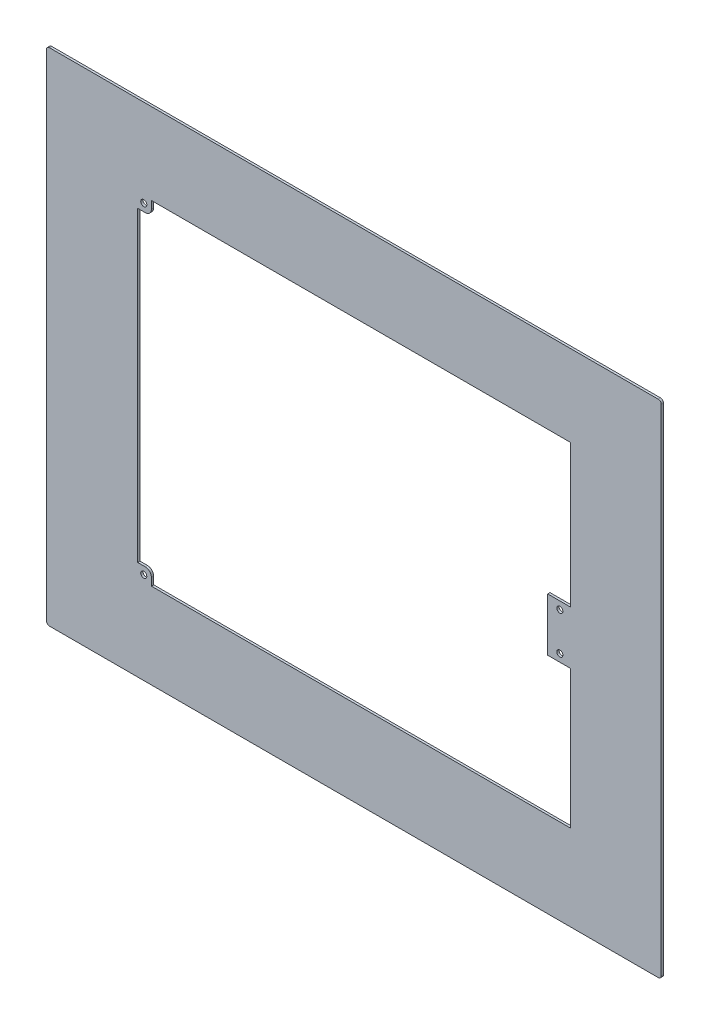
ISO-10303-21;
HEADER;
FILE_DESCRIPTION(('STEP AP214'),'2;1');
FILE_NAME('part.step','',(''),(''),'','','');
FILE_SCHEMA(('AUTOMOTIVE_DESIGN { 1 0 10303 214 1 1 1 1 }'));
ENDSEC;
DATA;
#1=APPLICATION_CONTEXT('core data for automotive mechanical design processes');
#2=APPLICATION_PROTOCOL_DEFINITION('international standard','automotive_design',2000,#1);
#3=PRODUCT_CONTEXT('',#1,'mechanical');
#4=PRODUCT('Part','Part','',(#3));
#5=PRODUCT_RELATED_PRODUCT_CATEGORY('part','',(#4));
#6=PRODUCT_DEFINITION_FORMATION('','',#4);
#7=PRODUCT_DEFINITION_CONTEXT('part definition',#1,'design');
#8=PRODUCT_DEFINITION('design','',#6,#7);
#9=PRODUCT_DEFINITION_SHAPE('','',#8);
#10=(LENGTH_UNIT() NAMED_UNIT(*) SI_UNIT(.MILLI.,.METRE.));
#11=(NAMED_UNIT(*) PLANE_ANGLE_UNIT() SI_UNIT($,.RADIAN.));
#12=(NAMED_UNIT(*) SI_UNIT($,.STERADIAN.) SOLID_ANGLE_UNIT());
#13=UNCERTAINTY_MEASURE_WITH_UNIT(LENGTH_MEASURE(1.E-05),#10,'distance_accuracy_value','');
#14=(GEOMETRIC_REPRESENTATION_CONTEXT(3) GLOBAL_UNCERTAINTY_ASSIGNED_CONTEXT((#13)) GLOBAL_UNIT_ASSIGNED_CONTEXT((#10,
#11,#12)) REPRESENTATION_CONTEXT('',''));
#15=CARTESIAN_POINT('',(0.,0.,0.));
#16=DIRECTION('',(0.,0.,1.));
#17=DIRECTION('',(1.,0.,0.));
#18=AXIS2_PLACEMENT_3D('',#15,#16,#17);
#19=CARTESIAN_POINT('',(142.71,111.43,0.));
#20=DIRECTION('',(1.,0.,0.));
#21=DIRECTION('',(0.,1.,0.));
#22=AXIS2_PLACEMENT_3D('',#19,#20,#21);
#23=PLANE('',#22);
#24=DIRECTION('',(0.,1.,0.));
#25=VECTOR('',#24,1.);
#26=CARTESIAN_POINT('',(142.71,111.43,0.));
#27=LINE('',#26,#25);
#28=CARTESIAN_POINT('',(142.71,17.5,0.));
#29=VERTEX_POINT('',#28);
#30=CARTESIAN_POINT('',(142.71,111.43,0.));
#31=VERTEX_POINT('',#30);
#32=EDGE_CURVE('E259',#29,#31,#27,.T.);
#33=ORIENTED_EDGE('',*,*,#32,.F.);
#34=DIRECTION('',(0.,0.,1.));
#35=VECTOR('',#34,1.);
#36=CARTESIAN_POINT('',(142.71,17.5,-38.0788655293196));
#37=LINE('',#36,#35);
#38=CARTESIAN_POINT('',(142.71,17.5,1.5));
#39=VERTEX_POINT('',#38);
#40=EDGE_CURVE('E205',#29,#39,#37,.T.);
#41=ORIENTED_EDGE('',*,*,#40,.T.);
#42=DIRECTION('',(0.,1.,0.));
#43=VECTOR('',#42,1.);
#44=CARTESIAN_POINT('',(142.71,111.43,1.5));
#45=LINE('',#44,#43);
#46=CARTESIAN_POINT('',(142.71,111.43,1.5));
#47=VERTEX_POINT('',#46);
#48=EDGE_CURVE('E270',#39,#47,#45,.T.);
#49=ORIENTED_EDGE('',*,*,#48,.T.);
#50=DIRECTION('',(0.,0.,1.));
#51=VECTOR('',#50,1.);
#52=CARTESIAN_POINT('',(142.71,111.43,0.));
#53=LINE('',#52,#51);
#54=EDGE_CURVE('E276',#31,#47,#53,.T.);
#55=ORIENTED_EDGE('',*,*,#54,.F.);
#56=EDGE_LOOP('',(#33,#41,#49,#55));
#57=FACE_BOUND('',#56,.T.);
#58=ADVANCED_FACE('F33',(#57),#23,.F.);
#59=CARTESIAN_POINT('',(202.5,-165.,1.5));
#60=DIRECTION('',(-1.,0.,0.));
#61=DIRECTION('',(0.,0.,1.));
#62=AXIS2_PLACEMENT_3D('',#59,#60,#61);
#63=PLANE('',#62);
#64=DIRECTION('',(0.,1.,0.));
#65=VECTOR('',#64,1.);
#66=CARTESIAN_POINT('',(202.5,-165.,0.));
#67=LINE('',#66,#65);
#68=CARTESIAN_POINT('',(202.5,-163.,0.));
#69=VERTEX_POINT('',#68);
#70=CARTESIAN_POINT('',(202.5,163.,0.));
#71=VERTEX_POINT('',#70);
#72=EDGE_CURVE('E279',#69,#71,#67,.T.);
#73=ORIENTED_EDGE('',*,*,#72,.T.);
#74=DIRECTION('',(0.,0.,-1.));
#75=VECTOR('',#74,1.);
#76=CARTESIAN_POINT('',(202.5,163.,1.5));
#77=LINE('',#76,#75);
#78=CARTESIAN_POINT('',(202.5,163.,1.5));
#79=VERTEX_POINT('',#78);
#80=EDGE_CURVE('E348',#71,#79,#77,.F.);
#81=ORIENTED_EDGE('',*,*,#80,.T.);
#82=DIRECTION('',(0.,1.,0.));
#83=VECTOR('',#82,1.);
#84=CARTESIAN_POINT('',(202.5,-165.,1.5));
#85=LINE('',#84,#83);
#86=CARTESIAN_POINT('',(202.5,-163.,1.5));
#87=VERTEX_POINT('',#86);
#88=EDGE_CURVE('E282',#87,#79,#85,.T.);
#89=ORIENTED_EDGE('',*,*,#88,.F.);
#90=DIRECTION('',(0.,0.,-1.));
#91=VECTOR('',#90,1.);
#92=CARTESIAN_POINT('',(202.5,-163.,1.5));
#93=LINE('',#92,#91);
#94=EDGE_CURVE('E345',#87,#69,#93,.T.);
#95=ORIENTED_EDGE('',*,*,#94,.T.);
#96=EDGE_LOOP('',(#73,#81,#89,#95));
#97=FACE_BOUND('',#96,.T.);
#98=ADVANCED_FACE('F362',(#97),#63,.F.);
#99=CARTESIAN_POINT('',(-202.5,165.,1.5));
#100=DIRECTION('',(0.,-1.,0.));
#101=DIRECTION('',(0.,0.,-1.));
#102=AXIS2_PLACEMENT_3D('',#99,#100,#101);
#103=PLANE('',#102);
#104=DIRECTION('',(-1.,0.,0.));
#105=VECTOR('',#104,1.);
#106=CARTESIAN_POINT('',(-202.5,165.,0.));
#107=LINE('',#106,#105);
#108=CARTESIAN_POINT('',(200.5,165.,0.));
#109=VERTEX_POINT('',#108);
#110=CARTESIAN_POINT('',(-200.5,165.,0.));
#111=VERTEX_POINT('',#110);
#112=EDGE_CURVE('E296',#109,#111,#107,.T.);
#113=ORIENTED_EDGE('',*,*,#112,.T.);
#114=DIRECTION('',(0.,0.,-1.));
#115=VECTOR('',#114,1.);
#116=CARTESIAN_POINT('',(-200.5,165.,1.5));
#117=LINE('',#116,#115);
#118=CARTESIAN_POINT('',(-200.5,165.,1.5));
#119=VERTEX_POINT('',#118);
#120=EDGE_CURVE('E336',#111,#119,#117,.F.);
#121=ORIENTED_EDGE('',*,*,#120,.T.);
#122=DIRECTION('',(-1.,0.,0.));
#123=VECTOR('',#122,1.);
#124=CARTESIAN_POINT('',(-202.5,165.,1.5));
#125=LINE('',#124,#123);
#126=CARTESIAN_POINT('',(200.5,165.,1.5));
#127=VERTEX_POINT('',#126);
#128=EDGE_CURVE('E285',#127,#119,#125,.T.);
#129=ORIENTED_EDGE('',*,*,#128,.F.);
#130=DIRECTION('',(0.,0.,-1.));
#131=VECTOR('',#130,1.);
#132=CARTESIAN_POINT('',(200.5,165.,1.5));
#133=LINE('',#132,#131);
#134=EDGE_CURVE('E333',#127,#109,#133,.T.);
#135=ORIENTED_EDGE('',*,*,#134,.T.);
#136=EDGE_LOOP('',(#113,#121,#129,#135));
#137=FACE_BOUND('',#136,.T.);
#138=ADVANCED_FACE('F372',(#137),#103,.F.);
#139=CARTESIAN_POINT('',(-202.5,-165.,1.5));
#140=DIRECTION('',(1.,0.,0.));
#141=DIRECTION('',(0.,0.,-1.));
#142=AXIS2_PLACEMENT_3D('',#139,#140,#141);
#143=PLANE('',#142);
#144=DIRECTION('',(0.,-1.,0.));
#145=VECTOR('',#144,1.);
#146=CARTESIAN_POINT('',(-202.5,-165.,1.5));
#147=LINE('',#146,#145);
#148=CARTESIAN_POINT('',(-202.5,163.,1.5));
#149=VERTEX_POINT('',#148);
#150=CARTESIAN_POINT('',(-202.5,-163.,1.5));
#151=VERTEX_POINT('',#150);
#152=EDGE_CURVE('E289',#149,#151,#147,.T.);
#153=ORIENTED_EDGE('',*,*,#152,.F.);
#154=DIRECTION('',(0.,0.,-1.));
#155=VECTOR('',#154,1.);
#156=CARTESIAN_POINT('',(-202.5,163.,1.5));
#157=LINE('',#156,#155);
#158=CARTESIAN_POINT('',(-202.5,163.,0.));
#159=VERTEX_POINT('',#158);
#160=EDGE_CURVE('E322',#149,#159,#157,.T.);
#161=ORIENTED_EDGE('',*,*,#160,.T.);
#162=DIRECTION('',(0.,-1.,0.));
#163=VECTOR('',#162,1.);
#164=CARTESIAN_POINT('',(-202.5,-165.,0.));
#165=LINE('',#164,#163);
#166=CARTESIAN_POINT('',(-202.5,-163.,0.));
#167=VERTEX_POINT('',#166);
#168=EDGE_CURVE('E299',#159,#167,#165,.T.);
#169=ORIENTED_EDGE('',*,*,#168,.T.);
#170=DIRECTION('',(0.,0.,-1.));
#171=VECTOR('',#170,1.);
#172=CARTESIAN_POINT('',(-202.5,-163.,1.5));
#173=LINE('',#172,#171);
#174=EDGE_CURVE('E320',#167,#151,#173,.F.);
#175=ORIENTED_EDGE('',*,*,#174,.T.);
#176=EDGE_LOOP('',(#153,#161,#169,#175));
#177=FACE_BOUND('',#176,.T.);
#178=ADVANCED_FACE('F380',(#177),#143,.F.);
#179=CARTESIAN_POINT('',(-202.5,-165.,1.5));
#180=DIRECTION('',(0.,1.,0.));
#181=DIRECTION('',(0.,0.,1.));
#182=AXIS2_PLACEMENT_3D('',#179,#180,#181);
#183=PLANE('',#182);
#184=DIRECTION('',(1.,0.,0.));
#185=VECTOR('',#184,1.);
#186=CARTESIAN_POINT('',(-202.5,-165.,0.));
#187=LINE('',#186,#185);
#188=CARTESIAN_POINT('',(-200.5,-165.,0.));
#189=VERTEX_POINT('',#188);
#190=CARTESIAN_POINT('',(200.5,-165.,0.));
#191=VERTEX_POINT('',#190);
#192=EDGE_CURVE('E286',#189,#191,#187,.T.);
#193=ORIENTED_EDGE('',*,*,#192,.T.);
#194=DIRECTION('',(0.,0.,-1.));
#195=VECTOR('',#194,1.);
#196=CARTESIAN_POINT('',(200.5,-165.,1.5));
#197=LINE('',#196,#195);
#198=CARTESIAN_POINT('',(200.5,-165.,1.5));
#199=VERTEX_POINT('',#198);
#200=EDGE_CURVE('E11',#191,#199,#197,.F.);
#201=ORIENTED_EDGE('',*,*,#200,.T.);
#202=DIRECTION('',(1.,0.,0.));
#203=VECTOR('',#202,1.);
#204=CARTESIAN_POINT('',(-202.5,-165.,1.5));
#205=LINE('',#204,#203);
#206=CARTESIAN_POINT('',(-200.5,-165.,1.5));
#207=VERTEX_POINT('',#206);
#208=EDGE_CURVE('E291',#207,#199,#205,.T.);
#209=ORIENTED_EDGE('',*,*,#208,.F.);
#210=DIRECTION('',(0.,0.,-1.));
#211=VECTOR('',#210,1.);
#212=CARTESIAN_POINT('',(-200.5,-165.,1.5));
#213=LINE('',#212,#211);
#214=EDGE_CURVE('E41',#207,#189,#213,.T.);
#215=ORIENTED_EDGE('',*,*,#214,.T.);
#216=EDGE_LOOP('',(#193,#201,#209,#215));
#217=FACE_BOUND('',#216,.T.);
#218=ADVANCED_FACE('F352',(#217),#183,.F.);
#219=CARTESIAN_POINT('',(0.,0.,1.5));
#220=DIRECTION('',(0.,0.,-1.));
#221=DIRECTION('',(-1.,0.,0.));
#222=AXIS2_PLACEMENT_3D('',#219,#220,#221);
#223=PLANE('',#222);
#224=CARTESIAN_POINT('',(-138.41,107.43,1.5));
#225=DIRECTION('',(0.,0.,1.));
#226=DIRECTION('',(1.,0.,0.));
#227=AXIS2_PLACEMENT_3D('',#224,#225,#226);
#228=CIRCLE('',#227,2.);
#229=CARTESIAN_POINT('',(-136.41,107.43,1.5));
#230=VERTEX_POINT('',#229);
#231=EDGE_CURVE('E465',#230,#230,#228,.T.);
#232=ORIENTED_EDGE('',*,*,#231,.F.);
#233=EDGE_LOOP('',(#232));
#234=FACE_BOUND('',#233,.T.);
#235=CARTESIAN_POINT('',(135.71,-12.5,1.5));
#236=DIRECTION('',(0.,0.,1.));
#237=DIRECTION('',(1.,0.,0.));
#238=AXIS2_PLACEMENT_3D('',#235,#236,#237);
#239=CIRCLE('',#238,2.);
#240=CARTESIAN_POINT('',(137.71,-12.5,1.5));
#241=VERTEX_POINT('',#240);
#242=EDGE_CURVE('E477',#241,#241,#239,.T.);
#243=ORIENTED_EDGE('',*,*,#242,.F.);
#244=EDGE_LOOP('',(#243));
#245=FACE_BOUND('',#244,.T.);
#246=CARTESIAN_POINT('',(135.71,12.5,1.5));
#247=DIRECTION('',(0.,0.,1.));
#248=DIRECTION('',(1.,0.,0.));
#249=AXIS2_PLACEMENT_3D('',#246,#247,#248);
#250=CIRCLE('',#249,2.);
#251=CARTESIAN_POINT('',(137.71,12.5,1.5));
#252=VERTEX_POINT('',#251);
#253=EDGE_CURVE('E476',#252,#252,#250,.T.);
#254=ORIENTED_EDGE('',*,*,#253,.F.);
#255=EDGE_LOOP('',(#254));
#256=FACE_BOUND('',#255,.T.);
#257=CARTESIAN_POINT('',(-138.41,-104.6,1.5));
#258=DIRECTION('',(0.,0.,1.));
#259=DIRECTION('',(1.,0.,0.));
#260=AXIS2_PLACEMENT_3D('',#257,#258,#259);
#261=CIRCLE('',#260,2.);
#262=CARTESIAN_POINT('',(-136.41,-104.6,1.5));
#263=VERTEX_POINT('',#262);
#264=EDGE_CURVE('E482',#263,#263,#261,.T.);
#265=ORIENTED_EDGE('',*,*,#264,.F.);
#266=EDGE_LOOP('',(#265));
#267=FACE_BOUND('',#266,.T.);
#268=DIRECTION('',(0.,1.,0.));
#269=VECTOR('',#268,1.);
#270=CARTESIAN_POINT('',(-133.41,-108.6,1.5));
#271=LINE('',#270,#269);
#272=CARTESIAN_POINT('',(-133.41,-108.6,1.5));
#273=VERTEX_POINT('',#272);
#274=CARTESIAN_POINT('',(-133.41,-103.6,1.5));
#275=VERTEX_POINT('',#274);
#276=EDGE_CURVE('E220',#273,#275,#271,.T.);
#277=ORIENTED_EDGE('',*,*,#276,.T.);
#278=CARTESIAN_POINT('',(-137.41,-103.6,1.5));
#279=DIRECTION('',(0.,0.,-1.));
#280=DIRECTION('',(-1.,0.,0.));
#281=AXIS2_PLACEMENT_3D('',#278,#279,#280);
#282=CIRCLE('',#281,4.);
#283=CARTESIAN_POINT('',(-137.41,-99.6,1.5));
#284=VERTEX_POINT('',#283);
#285=EDGE_CURVE('E307',#275,#284,#282,.F.);
#286=ORIENTED_EDGE('',*,*,#285,.T.);
#287=DIRECTION('',(-1.,0.,0.));
#288=VECTOR('',#287,1.);
#289=CARTESIAN_POINT('',(-142.41,-99.6,1.5));
#290=LINE('',#289,#288);
#291=CARTESIAN_POINT('',(-142.41,-99.6,1.5));
#292=VERTEX_POINT('',#291);
#293=EDGE_CURVE('E221',#284,#292,#290,.T.);
#294=ORIENTED_EDGE('',*,*,#293,.T.);
#295=DIRECTION('',(0.,-1.,0.));
#296=VECTOR('',#295,1.);
#297=CARTESIAN_POINT('',(-142.41,111.43,1.5));
#298=LINE('',#297,#296);
#299=CARTESIAN_POINT('',(-142.41,102.43,1.5));
#300=VERTEX_POINT('',#299);
#301=EDGE_CURVE('E252',#300,#292,#298,.T.);
#302=ORIENTED_EDGE('',*,*,#301,.F.);
#303=DIRECTION('',(1.,0.,0.));
#304=VECTOR('',#303,1.);
#305=CARTESIAN_POINT('',(-142.41,102.43,1.5));
#306=LINE('',#305,#304);
#307=CARTESIAN_POINT('',(-137.41,102.43,1.5));
#308=VERTEX_POINT('',#307);
#309=EDGE_CURVE('E234',#300,#308,#306,.T.);
#310=ORIENTED_EDGE('',*,*,#309,.T.);
#311=CARTESIAN_POINT('',(-137.41,106.43,1.5));
#312=DIRECTION('',(0.,0.,-1.));
#313=DIRECTION('',(-1.,0.,0.));
#314=AXIS2_PLACEMENT_3D('',#311,#312,#313);
#315=CIRCLE('',#314,4.);
#316=CARTESIAN_POINT('',(-133.41,106.43,1.5));
#317=VERTEX_POINT('',#316);
#318=EDGE_CURVE('E305',#308,#317,#315,.F.);
#319=ORIENTED_EDGE('',*,*,#318,.T.);
#320=DIRECTION('',(0.,1.,0.));
#321=VECTOR('',#320,1.);
#322=CARTESIAN_POINT('',(-133.41,111.43,1.5));
#323=LINE('',#322,#321);
#324=CARTESIAN_POINT('',(-133.41,111.43,1.5));
#325=VERTEX_POINT('',#324);
#326=EDGE_CURVE('E237',#317,#325,#323,.T.);
#327=ORIENTED_EDGE('',*,*,#326,.T.);
#328=DIRECTION('',(-1.,0.,0.));
#329=VECTOR('',#328,1.);
#330=CARTESIAN_POINT('',(-142.41,111.43,1.5));
#331=LINE('',#330,#329);
#332=EDGE_CURVE('E257',#47,#325,#331,.T.);
#333=ORIENTED_EDGE('',*,*,#332,.F.);
#334=ORIENTED_EDGE('',*,*,#48,.F.);
#335=DIRECTION('',(-1.,0.,0.));
#336=VECTOR('',#335,1.);
#337=CARTESIAN_POINT('',(142.71,17.5,1.5));
#338=LINE('',#337,#336);
#339=CARTESIAN_POINT('',(127.71,17.5,1.5));
#340=VERTEX_POINT('',#339);
#341=EDGE_CURVE('E213',#39,#340,#338,.T.);
#342=ORIENTED_EDGE('',*,*,#341,.T.);
#343=DIRECTION('',(0.,-1.,0.));
#344=VECTOR('',#343,1.);
#345=CARTESIAN_POINT('',(127.71,17.5,1.5));
#346=LINE('',#345,#344);
#347=CARTESIAN_POINT('',(127.71,-17.5,1.5));
#348=VERTEX_POINT('',#347);
#349=EDGE_CURVE('E199',#340,#348,#346,.T.);
#350=ORIENTED_EDGE('',*,*,#349,.T.);
#351=DIRECTION('',(1.,0.,0.));
#352=VECTOR('',#351,1.);
#353=CARTESIAN_POINT('',(142.71,-17.5,1.5));
#354=LINE('',#353,#352);
#355=CARTESIAN_POINT('',(142.71,-17.5,1.5));
#356=VERTEX_POINT('',#355);
#357=EDGE_CURVE('E207',#348,#356,#354,.T.);
#358=ORIENTED_EDGE('',*,*,#357,.T.);
#359=CARTESIAN_POINT('',(142.71,-108.6,1.5));
#360=VERTEX_POINT('',#359);
#361=EDGE_CURVE('E271',#360,#356,#45,.T.);
#362=ORIENTED_EDGE('',*,*,#361,.F.);
#363=DIRECTION('',(1.,0.,0.));
#364=VECTOR('',#363,1.);
#365=CARTESIAN_POINT('',(-142.41,-108.6,1.5));
#366=LINE('',#365,#364);
#367=EDGE_CURVE('E268',#273,#360,#366,.T.);
#368=ORIENTED_EDGE('',*,*,#367,.F.);
#369=EDGE_LOOP('',(#277,#286,#294,#302,#310,#319,#327,#333,#334,#342,#350,#358,#362,#368));
#370=FACE_BOUND('',#369,.T.);
#371=ORIENTED_EDGE('',*,*,#128,.T.);
#372=CARTESIAN_POINT('',(-200.5,163.,1.5));
#373=DIRECTION('',(0.,0.,-1.));
#374=DIRECTION('',(-1.,0.,0.));
#375=AXIS2_PLACEMENT_3D('',#372,#373,#374);
#376=CIRCLE('',#375,2.);
#377=EDGE_CURVE('E343',#119,#149,#376,.F.);
#378=ORIENTED_EDGE('',*,*,#377,.T.);
#379=ORIENTED_EDGE('',*,*,#152,.T.);
#380=CARTESIAN_POINT('',(-200.5,-163.,1.5));
#381=DIRECTION('',(0.,0.,-1.));
#382=DIRECTION('',(-1.,0.,0.));
#383=AXIS2_PLACEMENT_3D('',#380,#381,#382);
#384=CIRCLE('',#383,2.);
#385=EDGE_CURVE('E53',#151,#207,#384,.F.);
#386=ORIENTED_EDGE('',*,*,#385,.T.);
#387=ORIENTED_EDGE('',*,*,#208,.T.);
#388=CARTESIAN_POINT('',(200.5,-163.,1.5));
#389=DIRECTION('',(0.,0.,-1.));
#390=DIRECTION('',(-1.,0.,0.));
#391=AXIS2_PLACEMENT_3D('',#388,#389,#390);
#392=CIRCLE('',#391,2.);
#393=EDGE_CURVE('E339',#199,#87,#392,.F.);
#394=ORIENTED_EDGE('',*,*,#393,.T.);
#395=ORIENTED_EDGE('',*,*,#88,.T.);
#396=CARTESIAN_POINT('',(200.5,163.,1.5));
#397=DIRECTION('',(0.,0.,-1.));
#398=DIRECTION('',(-1.,0.,0.));
#399=AXIS2_PLACEMENT_3D('',#396,#397,#398);
#400=CIRCLE('',#399,2.);
#401=EDGE_CURVE('E341',#79,#127,#400,.F.);
#402=ORIENTED_EDGE('',*,*,#401,.T.);
#403=EDGE_LOOP('',(#371,#378,#379,#386,#387,#394,#395,#402));
#404=FACE_BOUND('',#403,.T.);
#405=ADVANCED_FACE('F365',(#234,#245,#256,#267,#370,#404),#223,.F.);
#406=CARTESIAN_POINT('',(0.,0.,0.));
#407=DIRECTION('',(0.,0.,-1.));
#408=DIRECTION('',(-1.,0.,0.));
#409=AXIS2_PLACEMENT_3D('',#406,#407,#408);
#410=PLANE('',#409);
#411=CARTESIAN_POINT('',(-138.41,107.43,0.));
#412=DIRECTION('',(0.,0.,1.));
#413=DIRECTION('',(1.,0.,0.));
#414=AXIS2_PLACEMENT_3D('',#411,#412,#413);
#415=CIRCLE('',#414,2.);
#416=CARTESIAN_POINT('',(-136.41,107.43,0.));
#417=VERTEX_POINT('',#416);
#418=EDGE_CURVE('E463',#417,#417,#415,.T.);
#419=ORIENTED_EDGE('',*,*,#418,.T.);
#420=EDGE_LOOP('',(#419));
#421=FACE_BOUND('',#420,.T.);
#422=CARTESIAN_POINT('',(135.71,-12.5,0.));
#423=DIRECTION('',(0.,0.,1.));
#424=DIRECTION('',(1.,0.,0.));
#425=AXIS2_PLACEMENT_3D('',#422,#423,#424);
#426=CIRCLE('',#425,2.);
#427=CARTESIAN_POINT('',(137.71,-12.5,0.));
#428=VERTEX_POINT('',#427);
#429=EDGE_CURVE('E473',#428,#428,#426,.T.);
#430=ORIENTED_EDGE('',*,*,#429,.T.);
#431=EDGE_LOOP('',(#430));
#432=FACE_BOUND('',#431,.T.);
#433=CARTESIAN_POINT('',(135.71,12.5,0.));
#434=DIRECTION('',(0.,0.,1.));
#435=DIRECTION('',(1.,0.,0.));
#436=AXIS2_PLACEMENT_3D('',#433,#434,#435);
#437=CIRCLE('',#436,2.);
#438=CARTESIAN_POINT('',(137.71,12.5,0.));
#439=VERTEX_POINT('',#438);
#440=EDGE_CURVE('E485',#439,#439,#437,.T.);
#441=ORIENTED_EDGE('',*,*,#440,.T.);
#442=EDGE_LOOP('',(#441));
#443=FACE_BOUND('',#442,.T.);
#444=CARTESIAN_POINT('',(-138.41,-104.6,0.));
#445=DIRECTION('',(0.,0.,1.));
#446=DIRECTION('',(1.,0.,0.));
#447=AXIS2_PLACEMENT_3D('',#444,#445,#446);
#448=CIRCLE('',#447,2.);
#449=CARTESIAN_POINT('',(-136.41,-104.6,0.));
#450=VERTEX_POINT('',#449);
#451=EDGE_CURVE('E470',#450,#450,#448,.T.);
#452=ORIENTED_EDGE('',*,*,#451,.T.);
#453=EDGE_LOOP('',(#452));
#454=FACE_BOUND('',#453,.T.);
#455=DIRECTION('',(-1.,0.,0.));
#456=VECTOR('',#455,1.);
#457=CARTESIAN_POINT('',(-142.41,-99.6,0.));
#458=LINE('',#457,#456);
#459=CARTESIAN_POINT('',(-137.41,-99.6,0.));
#460=VERTEX_POINT('',#459);
#461=CARTESIAN_POINT('',(-142.41,-99.6,0.));
#462=VERTEX_POINT('',#461);
#463=EDGE_CURVE('E226',#460,#462,#458,.T.);
#464=ORIENTED_EDGE('',*,*,#463,.F.);
#465=CARTESIAN_POINT('',(-137.41,-103.6,0.));
#466=DIRECTION('',(0.,0.,-1.));
#467=DIRECTION('',(-1.,0.,0.));
#468=AXIS2_PLACEMENT_3D('',#465,#466,#467);
#469=CIRCLE('',#468,4.);
#470=CARTESIAN_POINT('',(-133.41,-103.6,0.));
#471=VERTEX_POINT('',#470);
#472=EDGE_CURVE('E313',#460,#471,#469,.T.);
#473=ORIENTED_EDGE('',*,*,#472,.T.);
#474=DIRECTION('',(0.,1.,0.));
#475=VECTOR('',#474,1.);
#476=CARTESIAN_POINT('',(-133.41,-108.6,0.));
#477=LINE('',#476,#475);
#478=CARTESIAN_POINT('',(-133.41,-108.6,0.));
#479=VERTEX_POINT('',#478);
#480=EDGE_CURVE('E229',#479,#471,#477,.T.);
#481=ORIENTED_EDGE('',*,*,#480,.F.);
#482=DIRECTION('',(1.,0.,0.));
#483=VECTOR('',#482,1.);
#484=CARTESIAN_POINT('',(-142.41,-108.6,0.));
#485=LINE('',#484,#483);
#486=CARTESIAN_POINT('',(142.71,-108.6,0.));
#487=VERTEX_POINT('',#486);
#488=EDGE_CURVE('E256',#479,#487,#485,.T.);
#489=ORIENTED_EDGE('',*,*,#488,.T.);
#490=CARTESIAN_POINT('',(142.71,-17.5,0.));
#491=VERTEX_POINT('',#490);
#492=EDGE_CURVE('E260',#487,#491,#27,.T.);
#493=ORIENTED_EDGE('',*,*,#492,.T.);
#494=DIRECTION('',(1.,0.,0.));
#495=VECTOR('',#494,1.);
#496=CARTESIAN_POINT('',(142.71,-17.5,0.));
#497=LINE('',#496,#495);
#498=CARTESIAN_POINT('',(127.71,-17.5,0.));
#499=VERTEX_POINT('',#498);
#500=EDGE_CURVE('E190',#499,#491,#497,.T.);
#501=ORIENTED_EDGE('',*,*,#500,.F.);
#502=DIRECTION('',(0.,-1.,0.));
#503=VECTOR('',#502,1.);
#504=CARTESIAN_POINT('',(127.71,17.5,0.));
#505=LINE('',#504,#503);
#506=CARTESIAN_POINT('',(127.71,17.5,0.));
#507=VERTEX_POINT('',#506);
#508=EDGE_CURVE('E181',#507,#499,#505,.T.);
#509=ORIENTED_EDGE('',*,*,#508,.F.);
#510=DIRECTION('',(-1.,0.,0.));
#511=VECTOR('',#510,1.);
#512=CARTESIAN_POINT('',(142.71,17.5,0.));
#513=LINE('',#512,#511);
#514=EDGE_CURVE('E187',#29,#507,#513,.T.);
#515=ORIENTED_EDGE('',*,*,#514,.F.);
#516=ORIENTED_EDGE('',*,*,#32,.T.);
#517=DIRECTION('',(-1.,0.,0.));
#518=VECTOR('',#517,1.);
#519=CARTESIAN_POINT('',(-142.41,111.43,0.));
#520=LINE('',#519,#518);
#521=CARTESIAN_POINT('',(-133.41,111.43,0.));
#522=VERTEX_POINT('',#521);
#523=EDGE_CURVE('E262',#31,#522,#520,.T.);
#524=ORIENTED_EDGE('',*,*,#523,.T.);
#525=DIRECTION('',(0.,1.,0.));
#526=VECTOR('',#525,1.);
#527=CARTESIAN_POINT('',(-133.41,111.43,0.));
#528=LINE('',#527,#526);
#529=CARTESIAN_POINT('',(-133.41,106.43,0.));
#530=VERTEX_POINT('',#529);
#531=EDGE_CURVE('E244',#530,#522,#528,.T.);
#532=ORIENTED_EDGE('',*,*,#531,.F.);
#533=CARTESIAN_POINT('',(-137.41,106.43,0.));
#534=DIRECTION('',(0.,0.,-1.));
#535=DIRECTION('',(-1.,0.,0.));
#536=AXIS2_PLACEMENT_3D('',#533,#534,#535);
#537=CIRCLE('',#536,4.);
#538=CARTESIAN_POINT('',(-137.41,102.43,0.));
#539=VERTEX_POINT('',#538);
#540=EDGE_CURVE('E311',#530,#539,#537,.T.);
#541=ORIENTED_EDGE('',*,*,#540,.T.);
#542=DIRECTION('',(1.,0.,0.));
#543=VECTOR('',#542,1.);
#544=CARTESIAN_POINT('',(-142.41,102.43,0.));
#545=LINE('',#544,#543);
#546=CARTESIAN_POINT('',(-142.41,102.43,0.));
#547=VERTEX_POINT('',#546);
#548=EDGE_CURVE('E239',#547,#539,#545,.T.);
#549=ORIENTED_EDGE('',*,*,#548,.F.);
#550=DIRECTION('',(0.,-1.,0.));
#551=VECTOR('',#550,1.);
#552=CARTESIAN_POINT('',(-142.41,111.43,0.));
#553=LINE('',#552,#551);
#554=EDGE_CURVE('E253',#547,#462,#553,.T.);
#555=ORIENTED_EDGE('',*,*,#554,.T.);
#556=EDGE_LOOP('',(#464,#473,#481,#489,#493,#501,#509,#515,#516,#524,#532,#541,#549,#555));
#557=FACE_BOUND('',#556,.T.);
#558=ORIENTED_EDGE('',*,*,#168,.F.);
#559=CARTESIAN_POINT('',(-200.5,163.,0.));
#560=DIRECTION('',(0.,0.,-1.));
#561=DIRECTION('',(-1.,0.,0.));
#562=AXIS2_PLACEMENT_3D('',#559,#560,#561);
#563=CIRCLE('',#562,2.);
#564=EDGE_CURVE('E331',#159,#111,#563,.T.);
#565=ORIENTED_EDGE('',*,*,#564,.T.);
#566=ORIENTED_EDGE('',*,*,#112,.F.);
#567=CARTESIAN_POINT('',(200.5,163.,0.));
#568=DIRECTION('',(0.,0.,-1.));
#569=DIRECTION('',(-1.,0.,0.));
#570=AXIS2_PLACEMENT_3D('',#567,#568,#569);
#571=CIRCLE('',#570,2.);
#572=EDGE_CURVE('E329',#109,#71,#571,.T.);
#573=ORIENTED_EDGE('',*,*,#572,.T.);
#574=ORIENTED_EDGE('',*,*,#72,.F.);
#575=CARTESIAN_POINT('',(200.5,-163.,0.));
#576=DIRECTION('',(0.,0.,-1.));
#577=DIRECTION('',(-1.,0.,0.));
#578=AXIS2_PLACEMENT_3D('',#575,#576,#577);
#579=CIRCLE('',#578,2.);
#580=EDGE_CURVE('E327',#69,#191,#579,.T.);
#581=ORIENTED_EDGE('',*,*,#580,.T.);
#582=ORIENTED_EDGE('',*,*,#192,.F.);
#583=CARTESIAN_POINT('',(-200.5,-163.,0.));
#584=DIRECTION('',(0.,0.,-1.));
#585=DIRECTION('',(-1.,0.,0.));
#586=AXIS2_PLACEMENT_3D('',#583,#584,#585);
#587=CIRCLE('',#586,2.);
#588=EDGE_CURVE('E325',#189,#167,#587,.T.);
#589=ORIENTED_EDGE('',*,*,#588,.T.);
#590=EDGE_LOOP('',(#558,#565,#566,#573,#574,#581,#582,#589));
#591=FACE_BOUND('',#590,.T.);
#592=ADVANCED_FACE('F184',(#421,#432,#443,#454,#557,#591),#410,.T.);
#593=CARTESIAN_POINT('',(-142.41,111.43,0.));
#594=DIRECTION('',(-1.,0.,0.));
#595=DIRECTION('',(0.,-1.,0.));
#596=AXIS2_PLACEMENT_3D('',#593,#594,#595);
#597=PLANE('',#596);
#598=ORIENTED_EDGE('',*,*,#301,.T.);
#599=DIRECTION('',(0.,0.,1.));
#600=VECTOR('',#599,1.);
#601=CARTESIAN_POINT('',(-142.41,-99.6,-38.0788655293196));
#602=LINE('',#601,#600);
#603=EDGE_CURVE('E228',#462,#292,#602,.T.);
#604=ORIENTED_EDGE('',*,*,#603,.F.);
#605=ORIENTED_EDGE('',*,*,#554,.F.);
#606=DIRECTION('',(0.,0.,1.));
#607=VECTOR('',#606,1.);
#608=CARTESIAN_POINT('',(-142.41,102.43,-38.0788655293196));
#609=LINE('',#608,#607);
#610=EDGE_CURVE('E249',#547,#300,#609,.T.);
#611=ORIENTED_EDGE('',*,*,#610,.T.);
#612=EDGE_LOOP('',(#598,#604,#605,#611));
#613=FACE_BOUND('',#612,.T.);
#614=ADVANCED_FACE('F406',(#613),#597,.F.);
#615=CARTESIAN_POINT('',(-142.41,111.43,0.));
#616=DIRECTION('',(0.,1.,0.));
#617=DIRECTION('',(0.,0.,1.));
#618=AXIS2_PLACEMENT_3D('',#615,#616,#617);
#619=PLANE('',#618);
#620=ORIENTED_EDGE('',*,*,#332,.T.);
#621=DIRECTION('',(0.,0.,1.));
#622=VECTOR('',#621,1.);
#623=CARTESIAN_POINT('',(-133.41,111.43,-38.0788655293196));
#624=LINE('',#623,#622);
#625=EDGE_CURVE('E246',#522,#325,#624,.T.);
#626=ORIENTED_EDGE('',*,*,#625,.F.);
#627=ORIENTED_EDGE('',*,*,#523,.F.);
#628=ORIENTED_EDGE('',*,*,#54,.T.);
#629=EDGE_LOOP('',(#620,#626,#627,#628));
#630=FACE_BOUND('',#629,.T.);
#631=ADVANCED_FACE('F398',(#630),#619,.F.);
#632=ORIENTED_EDGE('',*,*,#361,.T.);
#633=DIRECTION('',(0.,0.,1.));
#634=VECTOR('',#633,1.);
#635=CARTESIAN_POINT('',(142.71,-17.5,-38.0788655293196));
#636=LINE('',#635,#634);
#637=EDGE_CURVE('E215',#491,#356,#636,.T.);
#638=ORIENTED_EDGE('',*,*,#637,.F.);
#639=ORIENTED_EDGE('',*,*,#492,.F.);
#640=DIRECTION('',(0.,0.,1.));
#641=VECTOR('',#640,1.);
#642=CARTESIAN_POINT('',(142.71,-108.6,0.));
#643=LINE('',#642,#641);
#644=EDGE_CURVE('E265',#487,#360,#643,.T.);
#645=ORIENTED_EDGE('',*,*,#644,.T.);
#646=EDGE_LOOP('',(#632,#638,#639,#645));
#647=FACE_BOUND('',#646,.T.);
#648=ADVANCED_FACE('F389',(#647),#23,.F.);
#649=CARTESIAN_POINT('',(-142.41,-108.6,0.));
#650=DIRECTION('',(0.,-1.,0.));
#651=DIRECTION('',(0.,0.,-1.));
#652=AXIS2_PLACEMENT_3D('',#649,#650,#651);
#653=PLANE('',#652);
#654=ORIENTED_EDGE('',*,*,#488,.F.);
#655=DIRECTION('',(0.,0.,1.));
#656=VECTOR('',#655,1.);
#657=CARTESIAN_POINT('',(-133.41,-108.6,-38.0788655293196));
#658=LINE('',#657,#656);
#659=EDGE_CURVE('E223',#479,#273,#658,.T.);
#660=ORIENTED_EDGE('',*,*,#659,.T.);
#661=ORIENTED_EDGE('',*,*,#367,.T.);
#662=ORIENTED_EDGE('',*,*,#644,.F.);
#663=EDGE_LOOP('',(#654,#660,#661,#662));
#664=FACE_BOUND('',#663,.T.);
#665=ADVANCED_FACE('F397',(#664),#653,.F.);
#666=CARTESIAN_POINT('',(-142.41,102.43,-38.0788655293196));
#667=DIRECTION('',(0.,-1.,0.));
#668=DIRECTION('',(0.,0.,-1.));
#669=AXIS2_PLACEMENT_3D('',#666,#667,#668);
#670=PLANE('',#669);
#671=ORIENTED_EDGE('',*,*,#548,.T.);
#672=DIRECTION('',(0.,0.,1.));
#673=VECTOR('',#672,1.);
#674=CARTESIAN_POINT('',(-137.41,102.43,-38.0788655293196));
#675=LINE('',#674,#673);
#676=EDGE_CURVE('E315',#539,#308,#675,.T.);
#677=ORIENTED_EDGE('',*,*,#676,.T.);
#678=ORIENTED_EDGE('',*,*,#309,.F.);
#679=ORIENTED_EDGE('',*,*,#610,.F.);
#680=EDGE_LOOP('',(#671,#677,#678,#679));
#681=FACE_BOUND('',#680,.T.);
#682=ADVANCED_FACE('F404',(#681),#670,.T.);
#683=CARTESIAN_POINT('',(-133.41,111.43,-38.0788655293196));
#684=DIRECTION('',(1.,0.,0.));
#685=DIRECTION('',(0.,0.,-1.));
#686=AXIS2_PLACEMENT_3D('',#683,#684,#685);
#687=PLANE('',#686);
#688=ORIENTED_EDGE('',*,*,#326,.F.);
#689=DIRECTION('',(0.,0.,1.));
#690=VECTOR('',#689,1.);
#691=CARTESIAN_POINT('',(-133.41,106.43,-38.0788655293196));
#692=LINE('',#691,#690);
#693=EDGE_CURVE('E318',#317,#530,#692,.F.);
#694=ORIENTED_EDGE('',*,*,#693,.T.);
#695=ORIENTED_EDGE('',*,*,#531,.T.);
#696=ORIENTED_EDGE('',*,*,#625,.T.);
#697=EDGE_LOOP('',(#688,#694,#695,#696));
#698=FACE_BOUND('',#697,.T.);
#699=ADVANCED_FACE('F439',(#698),#687,.T.);
#700=CARTESIAN_POINT('',(-133.41,-108.6,-38.0788655293196));
#701=DIRECTION('',(1.,0.,0.));
#702=DIRECTION('',(0.,1.,0.));
#703=AXIS2_PLACEMENT_3D('',#700,#701,#702);
#704=PLANE('',#703);
#705=ORIENTED_EDGE('',*,*,#480,.T.);
#706=DIRECTION('',(0.,0.,1.));
#707=VECTOR('',#706,1.);
#708=CARTESIAN_POINT('',(-133.41,-103.6,-38.0788655293196));
#709=LINE('',#708,#707);
#710=EDGE_CURVE('E293',#471,#275,#709,.T.);
#711=ORIENTED_EDGE('',*,*,#710,.T.);
#712=ORIENTED_EDGE('',*,*,#276,.F.);
#713=ORIENTED_EDGE('',*,*,#659,.F.);
#714=EDGE_LOOP('',(#705,#711,#712,#713));
#715=FACE_BOUND('',#714,.T.);
#716=ADVANCED_FACE('F435',(#715),#704,.T.);
#717=CARTESIAN_POINT('',(-142.41,-99.6,-38.0788655293196));
#718=DIRECTION('',(0.,1.,0.));
#719=DIRECTION('',(0.,0.,1.));
#720=AXIS2_PLACEMENT_3D('',#717,#718,#719);
#721=PLANE('',#720);
#722=ORIENTED_EDGE('',*,*,#293,.F.);
#723=DIRECTION('',(0.,0.,1.));
#724=VECTOR('',#723,1.);
#725=CARTESIAN_POINT('',(-137.41,-99.6,-38.0788655293196));
#726=LINE('',#725,#724);
#727=EDGE_CURVE('E309',#284,#460,#726,.F.);
#728=ORIENTED_EDGE('',*,*,#727,.T.);
#729=ORIENTED_EDGE('',*,*,#463,.T.);
#730=ORIENTED_EDGE('',*,*,#603,.T.);
#731=EDGE_LOOP('',(#722,#728,#729,#730));
#732=FACE_BOUND('',#731,.T.);
#733=ADVANCED_FACE('F432',(#732),#721,.T.);
#734=CARTESIAN_POINT('',(142.71,17.5,-38.0788655293196));
#735=DIRECTION('',(0.,1.,0.));
#736=DIRECTION('',(-1.,0.,0.));
#737=AXIS2_PLACEMENT_3D('',#734,#735,#736);
#738=PLANE('',#737);
#739=ORIENTED_EDGE('',*,*,#40,.F.);
#740=ORIENTED_EDGE('',*,*,#514,.T.);
#741=DIRECTION('',(0.,0.,1.));
#742=VECTOR('',#741,1.);
#743=CARTESIAN_POINT('',(127.71,17.5,-38.0788655293196));
#744=LINE('',#743,#742);
#745=EDGE_CURVE('E194',#507,#340,#744,.T.);
#746=ORIENTED_EDGE('',*,*,#745,.T.);
#747=ORIENTED_EDGE('',*,*,#341,.F.);
#748=EDGE_LOOP('',(#739,#740,#746,#747));
#749=FACE_BOUND('',#748,.T.);
#750=ADVANCED_FACE('F203',(#749),#738,.T.);
#751=CARTESIAN_POINT('',(127.71,17.5,-38.0788655293196));
#752=DIRECTION('',(-1.,0.,0.));
#753=DIRECTION('',(0.,0.,1.));
#754=AXIS2_PLACEMENT_3D('',#751,#752,#753);
#755=PLANE('',#754);
#756=ORIENTED_EDGE('',*,*,#745,.F.);
#757=ORIENTED_EDGE('',*,*,#508,.T.);
#758=DIRECTION('',(0.,0.,1.));
#759=VECTOR('',#758,1.);
#760=CARTESIAN_POINT('',(127.71,-17.5,-38.0788655293196));
#761=LINE('',#760,#759);
#762=EDGE_CURVE('E193',#499,#348,#761,.T.);
#763=ORIENTED_EDGE('',*,*,#762,.T.);
#764=ORIENTED_EDGE('',*,*,#349,.F.);
#765=EDGE_LOOP('',(#756,#757,#763,#764));
#766=FACE_BOUND('',#765,.T.);
#767=ADVANCED_FACE('F197',(#766),#755,.T.);
#768=CARTESIAN_POINT('',(142.71,-17.5,-38.0788655293196));
#769=DIRECTION('',(0.,-1.,0.));
#770=DIRECTION('',(1.,0.,0.));
#771=AXIS2_PLACEMENT_3D('',#768,#769,#770);
#772=PLANE('',#771);
#773=ORIENTED_EDGE('',*,*,#762,.F.);
#774=ORIENTED_EDGE('',*,*,#500,.T.);
#775=ORIENTED_EDGE('',*,*,#637,.T.);
#776=ORIENTED_EDGE('',*,*,#357,.F.);
#777=EDGE_LOOP('',(#773,#774,#775,#776));
#778=FACE_BOUND('',#777,.T.);
#779=ADVANCED_FACE('F416',(#778),#772,.T.);
#780=CARTESIAN_POINT('',(-138.41,-104.6,0.));
#781=DIRECTION('',(0.,0.,1.));
#782=DIRECTION('',(1.,0.,0.));
#783=AXIS2_PLACEMENT_3D('',#780,#781,#782);
#784=CYLINDRICAL_SURFACE('',#783,2.);
#785=ORIENTED_EDGE('',*,*,#451,.F.);
#786=EDGE_LOOP('',(#785));
#787=FACE_BOUND('',#786,.T.);
#788=ORIENTED_EDGE('',*,*,#264,.T.);
#789=EDGE_LOOP('',(#788));
#790=FACE_BOUND('',#789,.T.);
#791=ADVANCED_FACE('F418',(#787,#790),#784,.F.);
#792=CARTESIAN_POINT('',(135.71,12.5,0.));
#793=DIRECTION('',(0.,0.,1.));
#794=DIRECTION('',(1.,0.,0.));
#795=AXIS2_PLACEMENT_3D('',#792,#793,#794);
#796=CYLINDRICAL_SURFACE('',#795,2.);
#797=ORIENTED_EDGE('',*,*,#440,.F.);
#798=EDGE_LOOP('',(#797));
#799=FACE_BOUND('',#798,.T.);
#800=ORIENTED_EDGE('',*,*,#253,.T.);
#801=EDGE_LOOP('',(#800));
#802=FACE_BOUND('',#801,.T.);
#803=ADVANCED_FACE('F424',(#799,#802),#796,.F.);
#804=CARTESIAN_POINT('',(135.71,-12.5,0.));
#805=DIRECTION('',(0.,0.,1.));
#806=DIRECTION('',(1.,0.,0.));
#807=AXIS2_PLACEMENT_3D('',#804,#805,#806);
#808=CYLINDRICAL_SURFACE('',#807,2.);
#809=ORIENTED_EDGE('',*,*,#429,.F.);
#810=EDGE_LOOP('',(#809));
#811=FACE_BOUND('',#810,.T.);
#812=ORIENTED_EDGE('',*,*,#242,.T.);
#813=EDGE_LOOP('',(#812));
#814=FACE_BOUND('',#813,.T.);
#815=ADVANCED_FACE('F563',(#811,#814),#808,.F.);
#816=CARTESIAN_POINT('',(-138.41,107.43,0.));
#817=DIRECTION('',(0.,0.,1.));
#818=DIRECTION('',(1.,0.,0.));
#819=AXIS2_PLACEMENT_3D('',#816,#817,#818);
#820=CYLINDRICAL_SURFACE('',#819,2.);
#821=ORIENTED_EDGE('',*,*,#418,.F.);
#822=EDGE_LOOP('',(#821));
#823=FACE_BOUND('',#822,.T.);
#824=ORIENTED_EDGE('',*,*,#231,.T.);
#825=EDGE_LOOP('',(#824));
#826=FACE_BOUND('',#825,.T.);
#827=ADVANCED_FACE('F515',(#823,#826),#820,.F.);
#828=CARTESIAN_POINT('',(-137.41,-103.6,-38.0788655293196));
#829=DIRECTION('',(0.,0.,1.));
#830=DIRECTION('',(1.,0.,0.));
#831=AXIS2_PLACEMENT_3D('',#828,#829,#830);
#832=CYLINDRICAL_SURFACE('',#831,4.);
#833=ORIENTED_EDGE('',*,*,#472,.F.);
#834=ORIENTED_EDGE('',*,*,#727,.F.);
#835=ORIENTED_EDGE('',*,*,#285,.F.);
#836=ORIENTED_EDGE('',*,*,#710,.F.);
#837=EDGE_LOOP('',(#833,#834,#835,#836));
#838=FACE_BOUND('',#837,.T.);
#839=ADVANCED_FACE('F512',(#838),#832,.T.);
#840=CARTESIAN_POINT('',(-137.41,106.43,-38.0788655293196));
#841=DIRECTION('',(0.,0.,1.));
#842=DIRECTION('',(1.,0.,0.));
#843=AXIS2_PLACEMENT_3D('',#840,#841,#842);
#844=CYLINDRICAL_SURFACE('',#843,4.);
#845=ORIENTED_EDGE('',*,*,#540,.F.);
#846=ORIENTED_EDGE('',*,*,#693,.F.);
#847=ORIENTED_EDGE('',*,*,#318,.F.);
#848=ORIENTED_EDGE('',*,*,#676,.F.);
#849=EDGE_LOOP('',(#845,#846,#847,#848));
#850=FACE_BOUND('',#849,.T.);
#851=ADVANCED_FACE('F453',(#850),#844,.T.);
#852=CARTESIAN_POINT('',(-200.5,163.,1.5));
#853=DIRECTION('',(0.,0.,-1.));
#854=DIRECTION('',(-1.,0.,0.));
#855=AXIS2_PLACEMENT_3D('',#852,#853,#854);
#856=CYLINDRICAL_SURFACE('',#855,2.);
#857=ORIENTED_EDGE('',*,*,#377,.F.);
#858=ORIENTED_EDGE('',*,*,#120,.F.);
#859=ORIENTED_EDGE('',*,*,#564,.F.);
#860=ORIENTED_EDGE('',*,*,#160,.F.);
#861=EDGE_LOOP('',(#857,#858,#859,#860));
#862=FACE_BOUND('',#861,.T.);
#863=ADVANCED_FACE('F377',(#862),#856,.T.);
#864=CARTESIAN_POINT('',(200.5,163.,1.5));
#865=DIRECTION('',(0.,0.,-1.));
#866=DIRECTION('',(-1.,0.,0.));
#867=AXIS2_PLACEMENT_3D('',#864,#865,#866);
#868=CYLINDRICAL_SURFACE('',#867,2.);
#869=ORIENTED_EDGE('',*,*,#401,.F.);
#870=ORIENTED_EDGE('',*,*,#80,.F.);
#871=ORIENTED_EDGE('',*,*,#572,.F.);
#872=ORIENTED_EDGE('',*,*,#134,.F.);
#873=EDGE_LOOP('',(#869,#870,#871,#872));
#874=FACE_BOUND('',#873,.T.);
#875=ADVANCED_FACE('F369',(#874),#868,.T.);
#876=CARTESIAN_POINT('',(200.5,-163.,1.5));
#877=DIRECTION('',(0.,0.,-1.));
#878=DIRECTION('',(-1.,0.,0.));
#879=AXIS2_PLACEMENT_3D('',#876,#877,#878);
#880=CYLINDRICAL_SURFACE('',#879,2.);
#881=ORIENTED_EDGE('',*,*,#393,.F.);
#882=ORIENTED_EDGE('',*,*,#200,.F.);
#883=ORIENTED_EDGE('',*,*,#580,.F.);
#884=ORIENTED_EDGE('',*,*,#94,.F.);
#885=EDGE_LOOP('',(#881,#882,#883,#884));
#886=FACE_BOUND('',#885,.T.);
#887=ADVANCED_FACE('F359',(#886),#880,.T.);
#888=CARTESIAN_POINT('',(-200.5,-163.,1.5));
#889=DIRECTION('',(0.,0.,-1.));
#890=DIRECTION('',(-1.,0.,0.));
#891=AXIS2_PLACEMENT_3D('',#888,#889,#890);
#892=CYLINDRICAL_SURFACE('',#891,2.);
#893=ORIENTED_EDGE('',*,*,#385,.F.);
#894=ORIENTED_EDGE('',*,*,#174,.F.);
#895=ORIENTED_EDGE('',*,*,#588,.F.);
#896=ORIENTED_EDGE('',*,*,#214,.F.);
#897=EDGE_LOOP('',(#893,#894,#895,#896));
#898=FACE_BOUND('',#897,.T.);
#899=ADVANCED_FACE('F35',(#898),#892,.T.);
#900=CLOSED_SHELL('',(#58,#98,#138,#178,#218,#405,#592,#614,#631,#648,#665,#682,#699,#716,#733,
#750,#767,#779,#791,#803,#815,#827,#839,#851,#863,#875,#887,#899));
#901=MANIFOLD_SOLID_BREP('B2',#900);
#902=ADVANCED_BREP_SHAPE_REPRESENTATION('',(#18,#901),#14);
#903=SHAPE_DEFINITION_REPRESENTATION(#9,#902);
ENDSEC;
END-ISO-10303-21;
